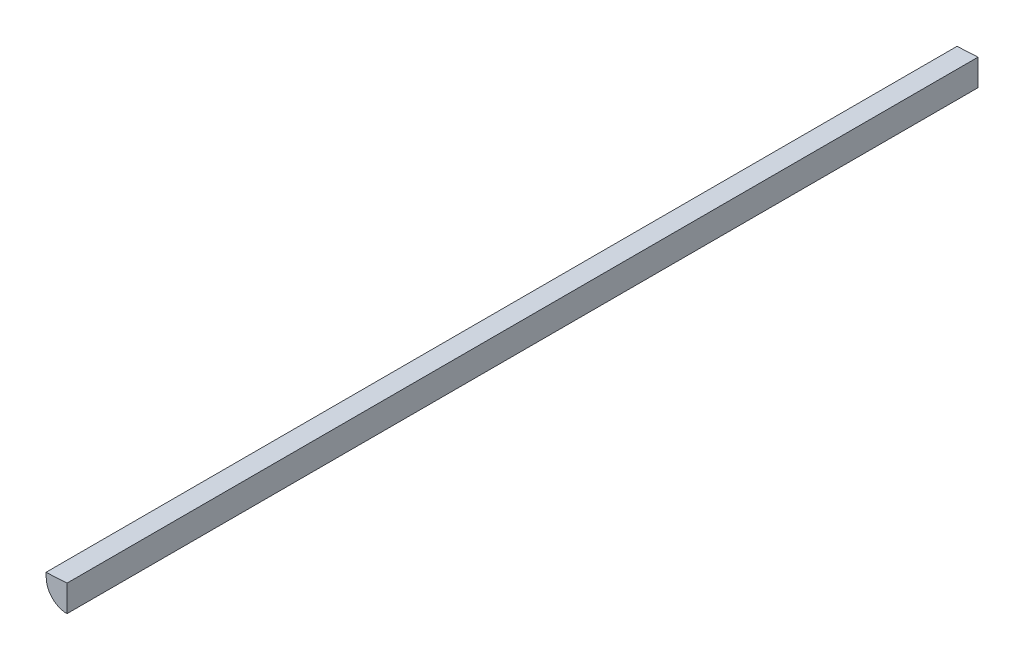
ISO-10303-21;
HEADER;
FILE_DESCRIPTION(('STEP AP214'),'2;1');
FILE_NAME('part.step','',(''),(''),'','','');
FILE_SCHEMA(('AUTOMOTIVE_DESIGN { 1 0 10303 214 1 1 1 1 }'));
ENDSEC;
DATA;
#1=APPLICATION_CONTEXT('core data for automotive mechanical design processes');
#2=APPLICATION_PROTOCOL_DEFINITION('international standard','automotive_design',2000,#1);
#3=PRODUCT_CONTEXT('',#1,'mechanical');
#4=PRODUCT('Part','Part','',(#3));
#5=PRODUCT_RELATED_PRODUCT_CATEGORY('part','',(#4));
#6=PRODUCT_DEFINITION_FORMATION('','',#4);
#7=PRODUCT_DEFINITION_CONTEXT('part definition',#1,'design');
#8=PRODUCT_DEFINITION('design','',#6,#7);
#9=PRODUCT_DEFINITION_SHAPE('','',#8);
#10=(LENGTH_UNIT() NAMED_UNIT(*) SI_UNIT(.MILLI.,.METRE.));
#11=(NAMED_UNIT(*) PLANE_ANGLE_UNIT() SI_UNIT($,.RADIAN.));
#12=(NAMED_UNIT(*) SI_UNIT($,.STERADIAN.) SOLID_ANGLE_UNIT());
#13=UNCERTAINTY_MEASURE_WITH_UNIT(LENGTH_MEASURE(1.E-05),#10,'distance_accuracy_value','');
#14=(GEOMETRIC_REPRESENTATION_CONTEXT(3) GLOBAL_UNCERTAINTY_ASSIGNED_CONTEXT((#13)) GLOBAL_UNIT_ASSIGNED_CONTEXT((#10,
#11,#12)) REPRESENTATION_CONTEXT('',''));
#15=CARTESIAN_POINT('',(0.,0.,0.));
#16=DIRECTION('',(0.,0.,1.));
#17=DIRECTION('',(1.,0.,0.));
#18=AXIS2_PLACEMENT_3D('',#15,#16,#17);
#19=CARTESIAN_POINT('',(0.,0.,550.));
#20=DIRECTION('',(0.,0.,-1.));
#21=DIRECTION('',(-1.,0.,0.));
#22=AXIS2_PLACEMENT_3D('',#19,#20,#21);
#23=CYLINDRICAL_SURFACE('',#22,12.5);
#24=CARTESIAN_POINT('',(0.,0.,0.));
#25=DIRECTION('',(0.,0.,1.));
#26=DIRECTION('',(1.,0.,0.));
#27=AXIS2_PLACEMENT_3D('',#24,#25,#26);
#28=CIRCLE('',#27,12.5);
#29=CARTESIAN_POINT('',(-12.4828691844322,-0.654199453036755,0.));
#30=VERTEX_POINT('',#29);
#31=CARTESIAN_POINT('',(0.,-12.5,0.));
#32=VERTEX_POINT('',#31);
#33=EDGE_CURVE('E99',#30,#32,#28,.T.);
#34=ORIENTED_EDGE('',*,*,#33,.T.);
#35=DIRECTION('',(0.,0.,-1.));
#36=VECTOR('',#35,1.);
#37=CARTESIAN_POINT('',(0.,-12.5,550.));
#38=LINE('',#37,#36);
#39=CARTESIAN_POINT('',(0.,-12.5,550.));
#40=VERTEX_POINT('',#39);
#41=EDGE_CURVE('E11',#40,#32,#38,.T.);
#42=ORIENTED_EDGE('',*,*,#41,.F.);
#43=CARTESIAN_POINT('',(0.,0.,550.));
#44=DIRECTION('',(0.,0.,1.));
#45=DIRECTION('',(1.,0.,0.));
#46=AXIS2_PLACEMENT_3D('',#43,#44,#45);
#47=CIRCLE('',#46,12.5);
#48=CARTESIAN_POINT('',(-12.4828691844322,-0.654199453036755,550.));
#49=VERTEX_POINT('',#48);
#50=EDGE_CURVE('E87',#49,#40,#47,.T.);
#51=ORIENTED_EDGE('',*,*,#50,.F.);
#52=DIRECTION('',(0.,0.,-1.));
#53=VECTOR('',#52,1.);
#54=CARTESIAN_POINT('',(-12.4828691844322,-0.654199453036755,550.));
#55=LINE('',#54,#53);
#56=EDGE_CURVE('E95',#49,#30,#55,.T.);
#57=ORIENTED_EDGE('',*,*,#56,.T.);
#58=EDGE_LOOP('',(#34,#42,#51,#57));
#59=FACE_BOUND('',#58,.T.);
#60=ADVANCED_FACE('F36',(#59),#23,.T.);
#61=CARTESIAN_POINT('',(0.,3.48477576407277,550.));
#62=DIRECTION('',(-1.,0.,0.));
#63=DIRECTION('',(0.,-1.,0.));
#64=AXIS2_PLACEMENT_3D('',#61,#62,#63);
#65=PLANE('',#64);
#66=DIRECTION('',(0.,1.,0.));
#67=VECTOR('',#66,1.);
#68=CARTESIAN_POINT('',(0.,3.48477576407277,0.));
#69=LINE('',#68,#67);
#70=CARTESIAN_POINT('',(0.,3.48477576407277,0.));
#71=VERTEX_POINT('',#70);
#72=EDGE_CURVE('E91',#32,#71,#69,.T.);
#73=ORIENTED_EDGE('',*,*,#72,.T.);
#74=DIRECTION('',(0.,0.,-1.));
#75=VECTOR('',#74,1.);
#76=CARTESIAN_POINT('',(0.,3.48477576407277,550.));
#77=LINE('',#76,#75);
#78=CARTESIAN_POINT('',(0.,3.48477576407277,550.));
#79=VERTEX_POINT('',#78);
#80=EDGE_CURVE('E44',#79,#71,#77,.T.);
#81=ORIENTED_EDGE('',*,*,#80,.F.);
#82=DIRECTION('',(0.,1.,0.));
#83=VECTOR('',#82,1.);
#84=CARTESIAN_POINT('',(0.,0.,550.));
#85=LINE('',#84,#83);
#86=EDGE_CURVE('E82',#40,#79,#85,.T.);
#87=ORIENTED_EDGE('',*,*,#86,.F.);
#88=ORIENTED_EDGE('',*,*,#41,.T.);
#89=EDGE_LOOP('',(#73,#81,#87,#88));
#90=FACE_BOUND('',#89,.T.);
#91=ADVANCED_FACE('F90',(#90),#65,.F.);
#92=CARTESIAN_POINT('',(-12.6649983121576,2.82103132790916,550.));
#93=DIRECTION('',(0.0523359562429408,-0.998629534754574,0.));
#94=DIRECTION('',(0.998629534754574,0.0523359562429408,0.));
#95=AXIS2_PLACEMENT_3D('',#92,#93,#94);
#96=PLANE('',#95);
#97=DIRECTION('',(-0.998629534754574,-0.0523359562429408,0.));
#98=VECTOR('',#97,1.);
#99=CARTESIAN_POINT('',(-12.6649983121576,2.82103132790916,0.));
#100=LINE('',#99,#98);
#101=CARTESIAN_POINT('',(-12.6649983121576,2.82103132790916,0.));
#102=VERTEX_POINT('',#101);
#103=EDGE_CURVE('E69',#71,#102,#100,.T.);
#104=ORIENTED_EDGE('',*,*,#103,.T.);
#105=DIRECTION('',(0.,0.,-1.));
#106=VECTOR('',#105,1.);
#107=CARTESIAN_POINT('',(-12.6649983121576,2.82103132790916,550.));
#108=LINE('',#107,#106);
#109=CARTESIAN_POINT('',(-12.6649983121576,2.82103132790916,550.));
#110=VERTEX_POINT('',#109);
#111=EDGE_CURVE('E92',#110,#102,#108,.T.);
#112=ORIENTED_EDGE('',*,*,#111,.F.);
#113=DIRECTION('',(-0.998629534754574,-0.0523359562429408,0.));
#114=VECTOR('',#113,1.);
#115=CARTESIAN_POINT('',(-12.6649983121576,2.82103132790916,550.));
#116=LINE('',#115,#114);
#117=EDGE_CURVE('E85',#79,#110,#116,.T.);
#118=ORIENTED_EDGE('',*,*,#117,.F.);
#119=ORIENTED_EDGE('',*,*,#80,.T.);
#120=EDGE_LOOP('',(#104,#112,#118,#119));
#121=FACE_BOUND('',#120,.T.);
#122=ADVANCED_FACE('F93',(#121),#96,.F.);
#123=CARTESIAN_POINT('',(-12.4828691844322,-0.654199453036755,550.));
#124=DIRECTION('',(0.998629534754574,0.0523359562429414,0.));
#125=DIRECTION('',(-0.0523359562429414,0.998629534754574,0.));
#126=AXIS2_PLACEMENT_3D('',#123,#124,#125);
#127=PLANE('',#126);
#128=DIRECTION('',(0.0523359562429414,-0.998629534754574,0.));
#129=VECTOR('',#128,1.);
#130=CARTESIAN_POINT('',(-12.4828691844322,-0.654199453036755,0.));
#131=LINE('',#130,#129);
#132=EDGE_CURVE('E75',#102,#30,#131,.T.);
#133=ORIENTED_EDGE('',*,*,#132,.T.);
#134=ORIENTED_EDGE('',*,*,#56,.F.);
#135=DIRECTION('',(0.0523359562429414,-0.998629534754574,0.));
#136=VECTOR('',#135,1.);
#137=CARTESIAN_POINT('',(-12.4828691844322,-0.654199453036755,550.));
#138=LINE('',#137,#136);
#139=EDGE_CURVE('E52',#110,#49,#138,.T.);
#140=ORIENTED_EDGE('',*,*,#139,.F.);
#141=ORIENTED_EDGE('',*,*,#111,.T.);
#142=EDGE_LOOP('',(#133,#134,#140,#141));
#143=FACE_BOUND('',#142,.T.);
#144=ADVANCED_FACE('F106',(#143),#127,.F.);
#145=CARTESIAN_POINT('',(0.,0.,550.));
#146=DIRECTION('',(0.,0.,1.));
#147=DIRECTION('',(1.,0.,0.));
#148=AXIS2_PLACEMENT_3D('',#145,#146,#147);
#149=PLANE('',#148);
#150=ORIENTED_EDGE('',*,*,#50,.T.);
#151=ORIENTED_EDGE('',*,*,#86,.T.);
#152=ORIENTED_EDGE('',*,*,#117,.T.);
#153=ORIENTED_EDGE('',*,*,#139,.T.);
#154=EDGE_LOOP('',(#150,#151,#152,#153));
#155=FACE_BOUND('',#154,.T.);
#156=ADVANCED_FACE('F83',(#155),#149,.T.);
#157=CARTESIAN_POINT('',(0.,0.,0.));
#158=DIRECTION('',(0.,0.,1.));
#159=DIRECTION('',(1.,0.,0.));
#160=AXIS2_PLACEMENT_3D('',#157,#158,#159);
#161=PLANE('',#160);
#162=ORIENTED_EDGE('',*,*,#33,.F.);
#163=ORIENTED_EDGE('',*,*,#132,.F.);
#164=ORIENTED_EDGE('',*,*,#103,.F.);
#165=ORIENTED_EDGE('',*,*,#72,.F.);
#166=EDGE_LOOP('',(#162,#163,#164,#165));
#167=FACE_BOUND('',#166,.T.);
#168=ADVANCED_FACE('F109',(#167),#161,.F.);
#169=CLOSED_SHELL('',(#60,#91,#122,#144,#156,#168));
#170=MANIFOLD_SOLID_BREP('B2',#169);
#171=ADVANCED_BREP_SHAPE_REPRESENTATION('',(#18,#170),#14);
#172=SHAPE_DEFINITION_REPRESENTATION(#9,#171);
ENDSEC;
END-ISO-10303-21;
